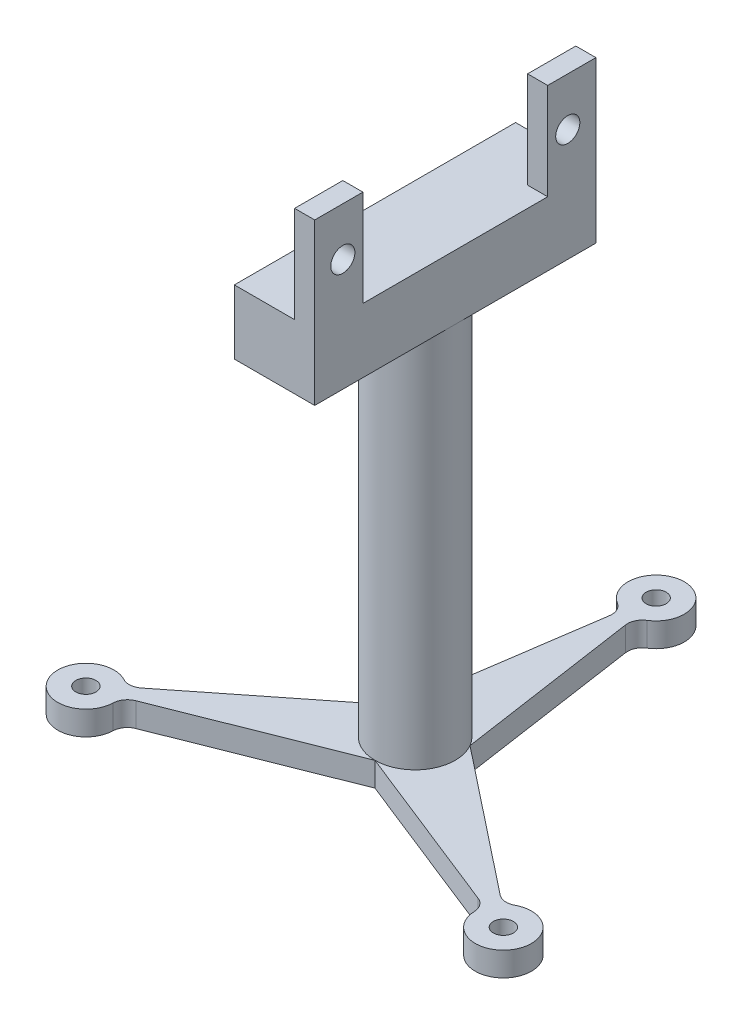
ISO-10303-21;
HEADER;
FILE_DESCRIPTION(('STEP AP214'),'2;1');
FILE_NAME('part.step','',(''),(''),'','','');
FILE_SCHEMA(('AUTOMOTIVE_DESIGN { 1 0 10303 214 1 1 1 1 }'));
ENDSEC;
DATA;
#1=APPLICATION_CONTEXT('core data for automotive mechanical design processes');
#2=APPLICATION_PROTOCOL_DEFINITION('international standard','automotive_design',2000,#1);
#3=PRODUCT_CONTEXT('',#1,'mechanical');
#4=PRODUCT('Part','Part','',(#3));
#5=PRODUCT_RELATED_PRODUCT_CATEGORY('part','',(#4));
#6=PRODUCT_DEFINITION_FORMATION('','',#4);
#7=PRODUCT_DEFINITION_CONTEXT('part definition',#1,'design');
#8=PRODUCT_DEFINITION('design','',#6,#7);
#9=PRODUCT_DEFINITION_SHAPE('','',#8);
#10=(LENGTH_UNIT() NAMED_UNIT(*) SI_UNIT(.MILLI.,.METRE.));
#11=(NAMED_UNIT(*) PLANE_ANGLE_UNIT() SI_UNIT($,.RADIAN.));
#12=(NAMED_UNIT(*) SI_UNIT($,.STERADIAN.) SOLID_ANGLE_UNIT());
#13=UNCERTAINTY_MEASURE_WITH_UNIT(LENGTH_MEASURE(1.E-05),#10,'distance_accuracy_value','');
#14=(GEOMETRIC_REPRESENTATION_CONTEXT(3) GLOBAL_UNCERTAINTY_ASSIGNED_CONTEXT((#13)) GLOBAL_UNIT_ASSIGNED_CONTEXT((#10,
#11,#12)) REPRESENTATION_CONTEXT('',''));
#15=CARTESIAN_POINT('',(0.,0.,0.));
#16=DIRECTION('',(0.,0.,1.));
#17=DIRECTION('',(1.,0.,0.));
#18=AXIS2_PLACEMENT_3D('',#15,#16,#17);
#19=CARTESIAN_POINT('',(-5.,58.,0.));
#20=DIRECTION('',(0.,-1.,0.));
#21=DIRECTION('',(0.,0.,-1.));
#22=AXIS2_PLACEMENT_3D('',#19,#20,#21);
#23=PLANE('',#22);
#24=DIRECTION('',(-1.,0.,0.));
#25=VECTOR('',#24,1.);
#26=CARTESIAN_POINT('',(5.,58.,-11.5));
#27=LINE('',#26,#25);
#28=CARTESIAN_POINT('',(5.,58.,-11.5));
#29=VERTEX_POINT('',#28);
#30=CARTESIAN_POINT('',(2.5,58.,-11.5));
#31=VERTEX_POINT('',#30);
#32=EDGE_CURVE('E265',#29,#31,#27,.T.);
#33=ORIENTED_EDGE('',*,*,#32,.T.);
#34=DIRECTION('',(0.,0.,1.));
#35=VECTOR('',#34,1.);
#36=CARTESIAN_POINT('',(2.5,58.,-33.5));
#37=LINE('',#36,#35);
#38=CARTESIAN_POINT('',(2.5,58.,-17.5));
#39=VERTEX_POINT('',#38);
#40=EDGE_CURVE('E227',#39,#31,#37,.T.);
#41=ORIENTED_EDGE('',*,*,#40,.F.);
#42=DIRECTION('',(1.,0.,0.));
#43=VECTOR('',#42,1.);
#44=CARTESIAN_POINT('',(-5.,58.,-17.5));
#45=LINE('',#44,#43);
#46=CARTESIAN_POINT('',(-5.,58.,-17.5));
#47=VERTEX_POINT('',#46);
#48=EDGE_CURVE('E564',#47,#39,#45,.T.);
#49=ORIENTED_EDGE('',*,*,#48,.F.);
#50=DIRECTION('',(0.,0.,-1.));
#51=VECTOR('',#50,1.);
#52=CARTESIAN_POINT('',(-5.,58.,0.));
#53=LINE('',#52,#51);
#54=CARTESIAN_POINT('',(-5.,58.,17.5));
#55=VERTEX_POINT('',#54);
#56=EDGE_CURVE('E213',#55,#47,#53,.T.);
#57=ORIENTED_EDGE('',*,*,#56,.F.);
#58=DIRECTION('',(1.,0.,0.));
#59=VECTOR('',#58,1.);
#60=CARTESIAN_POINT('',(-5.,58.,17.5));
#61=LINE('',#60,#59);
#62=CARTESIAN_POINT('',(2.5,58.,17.5));
#63=VERTEX_POINT('',#62);
#64=EDGE_CURVE('E208',#55,#63,#61,.T.);
#65=ORIENTED_EDGE('',*,*,#64,.T.);
#66=CARTESIAN_POINT('',(2.5,58.,11.5));
#67=VERTEX_POINT('',#66);
#68=EDGE_CURVE('E210',#67,#63,#37,.T.);
#69=ORIENTED_EDGE('',*,*,#68,.F.);
#70=DIRECTION('',(-1.,0.,0.));
#71=VECTOR('',#70,1.);
#72=CARTESIAN_POINT('',(5.,58.,11.5));
#73=LINE('',#72,#71);
#74=CARTESIAN_POINT('',(5.,58.,11.5));
#75=VERTEX_POINT('',#74);
#76=EDGE_CURVE('E57',#75,#67,#73,.T.);
#77=ORIENTED_EDGE('',*,*,#76,.F.);
#78=DIRECTION('',(0.,0.,-1.));
#79=VECTOR('',#78,1.);
#80=CARTESIAN_POINT('',(5.,58.,0.));
#81=LINE('',#80,#79);
#82=EDGE_CURVE('E52',#75,#29,#81,.T.);
#83=ORIENTED_EDGE('',*,*,#82,.T.);
#84=EDGE_LOOP('',(#33,#41,#49,#57,#65,#69,#77,#83));
#85=FACE_BOUND('',#84,.T.);
#86=ADVANCED_FACE('F35',(#85),#23,.F.);
#87=CARTESIAN_POINT('',(0.,0.,0.));
#88=DIRECTION('',(0.,-1.,0.));
#89=DIRECTION('',(0.,0.,-1.));
#90=AXIS2_PLACEMENT_3D('',#87,#88,#89);
#91=CYLINDRICAL_SURFACE('',#90,5.);
#92=CARTESIAN_POINT('',(0.,3.,0.));
#93=DIRECTION('',(0.,1.,0.));
#94=DIRECTION('',(0.,0.,1.));
#95=AXIS2_PLACEMENT_3D('',#92,#93,#94);
#96=CIRCLE('',#95,5.);
#97=CARTESIAN_POINT('',(0.,3.,5.));
#98=VERTEX_POINT('',#97);
#99=CARTESIAN_POINT('',(-4.33012701892217,3.,-2.50000000000004));
#100=VERTEX_POINT('',#99);
#101=EDGE_CURVE('E11',#98,#100,#96,.F.);
#102=ORIENTED_EDGE('',*,*,#101,.F.);
#103=CARTESIAN_POINT('',(0.,3.,0.));
#104=DIRECTION('',(0.,1.,0.));
#105=DIRECTION('',(0.,0.,1.));
#106=AXIS2_PLACEMENT_3D('',#103,#104,#105);
#107=CIRCLE('',#106,5.);
#108=CARTESIAN_POINT('',(4.33012701892221,3.,-2.49999999999998));
#109=VERTEX_POINT('',#108);
#110=EDGE_CURVE('E44',#109,#98,#107,.F.);
#111=ORIENTED_EDGE('',*,*,#110,.F.);
#112=CARTESIAN_POINT('',(0.,3.,0.));
#113=DIRECTION('',(0.,1.,0.));
#114=DIRECTION('',(0.,0.,1.));
#115=AXIS2_PLACEMENT_3D('',#112,#113,#114);
#116=CIRCLE('',#115,5.);
#117=EDGE_CURVE('E457',#100,#109,#116,.F.);
#118=ORIENTED_EDGE('',*,*,#117,.F.);
#119=EDGE_LOOP('',(#102,#111,#118));
#120=FACE_BOUND('',#119,.T.);
#121=CARTESIAN_POINT('',(0.,50.,0.));
#122=DIRECTION('',(0.,-1.,0.));
#123=DIRECTION('',(0.,0.,-1.));
#124=AXIS2_PLACEMENT_3D('',#121,#122,#123);
#125=CIRCLE('',#124,5.);
#126=CARTESIAN_POINT('',(5.,50.,0.));
#127=VERTEX_POINT('',#126);
#128=CARTESIAN_POINT('',(-5.,50.,0.));
#129=VERTEX_POINT('',#128);
#130=EDGE_CURVE('E454',#127,#129,#125,.T.);
#131=ORIENTED_EDGE('',*,*,#130,.T.);
#132=EDGE_CURVE('E453',#129,#127,#125,.T.);
#133=ORIENTED_EDGE('',*,*,#132,.T.);
#134=EDGE_LOOP('',(#131,#133));
#135=FACE_BOUND('',#134,.T.);
#136=ADVANCED_FACE('F312',(#120,#135),#91,.T.);
#137=CARTESIAN_POINT('',(5.00000000000001,0.,0.));
#138=DIRECTION('',(0.,-1.,0.));
#139=DIRECTION('',(0.,0.,-1.));
#140=AXIS2_PLACEMENT_3D('',#137,#138,#139);
#141=PLANE('',#140);
#142=DIRECTION('',(0.929467097060338,0.,0.368905022305509));
#143=VECTOR('',#142,1.);
#144=CARTESIAN_POINT('',(-1.71442540086641,0.,4.31954542258887));
#145=LINE('',#144,#143);
#146=CARTESIAN_POINT('',(0.,0.,5.));
#147=VERTEX_POINT('',#146);
#148=CARTESIAN_POINT('',(21.3094097195099,0.,13.4576939762104));
#149=VERTEX_POINT('',#148);
#150=EDGE_CURVE('E501',#147,#149,#145,.T.);
#151=ORIENTED_EDGE('',*,*,#150,.F.);
#152=DIRECTION('',(-0.929467097060343,0.,0.368905022305496));
#153=VECTOR('',#152,1.);
#154=CARTESIAN_POINT('',(1.71442540086635,0.,4.31954542258889));
#155=LINE('',#154,#153);
#156=CARTESIAN_POINT('',(-21.3094097195101,0.,13.4576939762101));
#157=VERTEX_POINT('',#156);
#158=EDGE_CURVE('E553',#147,#157,#155,.T.);
#159=ORIENTED_EDGE('',*,*,#158,.T.);
#160=CARTESIAN_POINT('',(-20.6227776308189,0.,15.1876837991618));
#161=DIRECTION('',(0.,1.,0.));
#162=DIRECTION('',(0.866025403784443,0.,-0.499999999999992));
#163=AXIS2_PLACEMENT_3D('',#160,#161,#162);
#164=CIRCLE('',#163,1.86127064467707);
#165=CARTESIAN_POINT('',(-22.4829074196802,0.,15.1225256735953));
#166=VERTEX_POINT('',#165);
#167=EDGE_CURVE('E489',#157,#166,#164,.T.);
#168=ORIENTED_EDGE('',*,*,#167,.T.);
#169=CARTESIAN_POINT('',(-25.9807621135333,0.,14.9999999999998));
#170=DIRECTION('',(0.,1.,0.));
#171=DIRECTION('',(0.866025403784443,0.,-0.499999999999992));
#172=AXIS2_PLACEMENT_3D('',#169,#170,#171);
#173=CIRCLE('',#172,3.5);
#174=CARTESIAN_POINT('',(-24.3379451125562,0.,11.9095061395786));
#175=VERTEX_POINT('',#174);
#176=EDGE_CURVE('E559',#175,#166,#173,.T.);
#177=ORIENTED_EDGE('',*,*,#176,.F.);
#178=CARTESIAN_POINT('',(-23.4643088101291,0.,10.2660074253053));
#179=DIRECTION('',(0.,1.,0.));
#180=DIRECTION('',(0.866025403784443,0.,-0.499999999999992));
#181=AXIS2_PLACEMENT_3D('',#178,#179,#180);
#182=CIRCLE('',#181,1.86127064467707);
#183=CARTESIAN_POINT('',(-22.30940971951,0.,11.7256431686413));
#184=VERTEX_POINT('',#183);
#185=EDGE_CURVE('E537',#184,#175,#182,.F.);
#186=ORIENTED_EDGE('',*,*,#185,.F.);
#187=DIRECTION('',(-0.784214669430408,0.,0.620489606883271));
#188=VECTOR('',#187,1.);
#189=CARTESIAN_POINT('',(-2.88362336832953,0.,-3.64450866133807));
#190=LINE('',#189,#188);
#191=CARTESIAN_POINT('',(-4.33012701892217,0.,-2.50000000000004));
#192=VERTEX_POINT('',#191);
#193=EDGE_CURVE('E535',#192,#184,#190,.T.);
#194=ORIENTED_EDGE('',*,*,#193,.F.);
#195=DIRECTION('',(0.145252427629938,0.,-0.989394629188783));
#196=VECTOR('',#195,1.);
#197=CARTESIAN_POINT('',(-4.59804876919595,0.,-0.675036761250828));
#198=LINE('',#197,#196);
#199=CARTESIAN_POINT('',(-1.,0.,-25.1833371448518));
#200=VERTEX_POINT('',#199);
#201=EDGE_CURVE('E433',#192,#200,#198,.T.);
#202=ORIENTED_EDGE('',*,*,#201,.T.);
#203=CARTESIAN_POINT('',(-2.84153117931023,0.,-25.4536912244675));
#204=DIRECTION('',(0.,1.,0.));
#205=DIRECTION('',(0.,0.,1.));
#206=AXIS2_PLACEMENT_3D('',#203,#204,#205);
#207=CIRCLE('',#206,1.86127064467707);
#208=CARTESIAN_POINT('',(-1.85503769287605,0.,-27.0320318131744));
#209=VERTEX_POINT('',#208);
#210=EDGE_CURVE('E430',#200,#209,#207,.T.);
#211=ORIENTED_EDGE('',*,*,#210,.T.);
#212=CARTESIAN_POINT('',(0.,0.,-30.));
#213=DIRECTION('',(0.,1.,0.));
#214=DIRECTION('',(0.,0.,1.));
#215=AXIS2_PLACEMENT_3D('',#212,#213,#214);
#216=CIRCLE('',#215,3.5);
#217=CARTESIAN_POINT('',(1.85503769287605,0.,-27.0320318131744));
#218=VERTEX_POINT('',#217);
#219=EDGE_CURVE('E419',#218,#209,#216,.T.);
#220=ORIENTED_EDGE('',*,*,#219,.F.);
#221=CARTESIAN_POINT('',(2.84153117931023,0.,-25.4536912244675));
#222=DIRECTION('',(0.,1.,0.));
#223=DIRECTION('',(0.,0.,1.));
#224=AXIS2_PLACEMENT_3D('',#221,#222,#223);
#225=CIRCLE('',#224,1.86127064467707);
#226=CARTESIAN_POINT('',(0.999999999999999,0.,-25.1833371448518));
#227=VERTEX_POINT('',#226);
#228=EDGE_CURVE('E415',#227,#218,#225,.F.);
#229=ORIENTED_EDGE('',*,*,#228,.F.);
#230=DIRECTION('',(-0.145252427629938,0.,-0.989394629188783));
#231=VECTOR('',#230,1.);
#232=CARTESIAN_POINT('',(4.59804876919595,0.,-0.675036761250828));
#233=LINE('',#232,#231);
#234=CARTESIAN_POINT('',(4.3301270189222,0.,-2.5));
#235=VERTEX_POINT('',#234);
#236=EDGE_CURVE('E436',#235,#227,#233,.T.);
#237=ORIENTED_EDGE('',*,*,#236,.F.);
#238=DIRECTION('',(0.784214669430399,0.,0.620489606883282));
#239=VECTOR('',#238,1.);
#240=CARTESIAN_POINT('',(2.88362336832958,0.,-3.64450866133804));
#241=LINE('',#240,#239);
#242=CARTESIAN_POINT('',(22.3094097195099,0.,11.7256431686416));
#243=VERTEX_POINT('',#242);
#244=EDGE_CURVE('E498',#235,#243,#241,.T.);
#245=ORIENTED_EDGE('',*,*,#244,.T.);
#246=CARTESIAN_POINT('',(23.464308810129,0.,10.2660074253056));
#247=DIRECTION('',(0.,1.,0.));
#248=DIRECTION('',(-0.866025403784436,0.,-0.500000000000004));
#249=AXIS2_PLACEMENT_3D('',#246,#247,#248);
#250=CIRCLE('',#249,1.86127064467707);
#251=CARTESIAN_POINT('',(24.3379451125561,0.,11.909506139579));
#252=VERTEX_POINT('',#251);
#253=EDGE_CURVE('E495',#243,#252,#250,.T.);
#254=ORIENTED_EDGE('',*,*,#253,.T.);
#255=CARTESIAN_POINT('',(25.9807621135331,0.,15.0000000000001));
#256=DIRECTION('',(0.,1.,0.));
#257=DIRECTION('',(-0.866025403784436,0.,-0.500000000000004));
#258=AXIS2_PLACEMENT_3D('',#255,#256,#257);
#259=CIRCLE('',#258,3.5);
#260=CARTESIAN_POINT('',(22.48290741968,0.,15.1225256735956));
#261=VERTEX_POINT('',#260);
#262=EDGE_CURVE('E492',#261,#252,#259,.T.);
#263=ORIENTED_EDGE('',*,*,#262,.F.);
#264=CARTESIAN_POINT('',(20.6227776308187,0.,15.1876837991621));
#265=DIRECTION('',(0.,1.,0.));
#266=DIRECTION('',(-0.866025403784436,0.,-0.500000000000004));
#267=AXIS2_PLACEMENT_3D('',#264,#265,#266);
#268=CIRCLE('',#267,1.86127064467707);
#269=EDGE_CURVE('E488',#149,#261,#268,.F.);
#270=ORIENTED_EDGE('',*,*,#269,.F.);
#271=EDGE_LOOP('',(#151,#159,#168,#177,#186,#194,#202,#211,#220,#229,#237,#245,#254,#263,#270));
#272=FACE_BOUND('',#271,.T.);
#273=CARTESIAN_POINT('',(25.9807621135331,0.,15.0000000000001));
#274=DIRECTION('',(0.,1.,0.));
#275=DIRECTION('',(-0.866025403784436,0.,-0.500000000000004));
#276=AXIS2_PLACEMENT_3D('',#273,#274,#275);
#277=CIRCLE('',#276,1.25);
#278=CARTESIAN_POINT('',(24.8982303588025,0.,14.3750000000001));
#279=VERTEX_POINT('',#278);
#280=EDGE_CURVE('E485',#279,#279,#277,.T.);
#281=ORIENTED_EDGE('',*,*,#280,.T.);
#282=EDGE_LOOP('',(#281));
#283=FACE_BOUND('',#282,.T.);
#284=CARTESIAN_POINT('',(0.,0.,-30.));
#285=DIRECTION('',(0.,1.,0.));
#286=DIRECTION('',(0.,0.,1.));
#287=AXIS2_PLACEMENT_3D('',#284,#285,#286);
#288=CIRCLE('',#287,1.25);
#289=CARTESIAN_POINT('',(0.,0.,-28.75));
#290=VERTEX_POINT('',#289);
#291=EDGE_CURVE('E413',#290,#290,#288,.T.);
#292=ORIENTED_EDGE('',*,*,#291,.T.);
#293=EDGE_LOOP('',(#292));
#294=FACE_BOUND('',#293,.T.);
#295=CARTESIAN_POINT('',(-25.9807621135333,0.,14.9999999999998));
#296=DIRECTION('',(0.,1.,0.));
#297=DIRECTION('',(0.866025403784443,0.,-0.499999999999992));
#298=AXIS2_PLACEMENT_3D('',#295,#296,#297);
#299=CIRCLE('',#298,1.25);
#300=CARTESIAN_POINT('',(-24.8982303588027,0.,14.3749999999998));
#301=VERTEX_POINT('',#300);
#302=EDGE_CURVE('E556',#301,#301,#299,.T.);
#303=ORIENTED_EDGE('',*,*,#302,.T.);
#304=EDGE_LOOP('',(#303));
#305=FACE_BOUND('',#304,.T.);
#306=ADVANCED_FACE('F37',(#272,#283,#294,#305),#141,.T.);
#307=CARTESIAN_POINT('',(2.84153117931023,3.,-25.4536912244675));
#308=DIRECTION('',(0.,-1.,0.));
#309=DIRECTION('',(0.,0.,-1.));
#310=AXIS2_PLACEMENT_3D('',#307,#308,#309);
#311=CYLINDRICAL_SURFACE('',#310,1.86127064467707);
#312=ORIENTED_EDGE('',*,*,#228,.T.);
#313=DIRECTION('',(0.,-1.,0.));
#314=VECTOR('',#313,1.);
#315=CARTESIAN_POINT('',(1.85503769287605,3.,-27.0320318131744));
#316=LINE('',#315,#314);
#317=CARTESIAN_POINT('',(1.85503769287605,3.,-27.0320318131744));
#318=VERTEX_POINT('',#317);
#319=EDGE_CURVE('E450',#318,#218,#316,.T.);
#320=ORIENTED_EDGE('',*,*,#319,.F.);
#321=CARTESIAN_POINT('',(2.84153117931023,3.,-25.4536912244675));
#322=DIRECTION('',(0.,1.,0.));
#323=DIRECTION('',(0.,0.,1.));
#324=AXIS2_PLACEMENT_3D('',#321,#322,#323);
#325=CIRCLE('',#324,1.86127064467707);
#326=CARTESIAN_POINT('',(0.999999999999999,3.,-25.1833371448518));
#327=VERTEX_POINT('',#326);
#328=EDGE_CURVE('E509',#327,#318,#325,.F.);
#329=ORIENTED_EDGE('',*,*,#328,.F.);
#330=DIRECTION('',(0.,-1.,0.));
#331=VECTOR('',#330,1.);
#332=CARTESIAN_POINT('',(0.999999999999999,3.,-25.1833371448518));
#333=LINE('',#332,#331);
#334=EDGE_CURVE('E438',#327,#227,#333,.T.);
#335=ORIENTED_EDGE('',*,*,#334,.T.);
#336=EDGE_LOOP('',(#312,#320,#329,#335));
#337=FACE_BOUND('',#336,.T.);
#338=ADVANCED_FACE('F398',(#337),#311,.F.);
#339=CARTESIAN_POINT('',(0.,3.,-30.));
#340=DIRECTION('',(0.,-1.,0.));
#341=DIRECTION('',(0.,0.,-1.));
#342=AXIS2_PLACEMENT_3D('',#339,#340,#341);
#343=CYLINDRICAL_SURFACE('',#342,3.5);
#344=ORIENTED_EDGE('',*,*,#219,.T.);
#345=DIRECTION('',(0.,-1.,0.));
#346=VECTOR('',#345,1.);
#347=CARTESIAN_POINT('',(-1.85503769287605,3.,-27.0320318131744));
#348=LINE('',#347,#346);
#349=CARTESIAN_POINT('',(-1.85503769287605,3.,-27.0320318131744));
#350=VERTEX_POINT('',#349);
#351=EDGE_CURVE('E448',#350,#209,#348,.T.);
#352=ORIENTED_EDGE('',*,*,#351,.F.);
#353=CARTESIAN_POINT('',(0.,3.,-30.));
#354=DIRECTION('',(0.,1.,0.));
#355=DIRECTION('',(0.,0.,1.));
#356=AXIS2_PLACEMENT_3D('',#353,#354,#355);
#357=CIRCLE('',#356,3.5);
#358=EDGE_CURVE('E512',#318,#350,#357,.T.);
#359=ORIENTED_EDGE('',*,*,#358,.F.);
#360=ORIENTED_EDGE('',*,*,#319,.T.);
#361=EDGE_LOOP('',(#344,#352,#359,#360));
#362=FACE_BOUND('',#361,.T.);
#363=ADVANCED_FACE('F394',(#362),#343,.T.);
#364=CARTESIAN_POINT('',(-2.84153117931023,3.,-25.4536912244675));
#365=DIRECTION('',(0.,-1.,0.));
#366=DIRECTION('',(0.,0.,-1.));
#367=AXIS2_PLACEMENT_3D('',#364,#365,#366);
#368=CYLINDRICAL_SURFACE('',#367,1.86127064467707);
#369=ORIENTED_EDGE('',*,*,#210,.F.);
#370=DIRECTION('',(0.,-1.,0.));
#371=VECTOR('',#370,1.);
#372=CARTESIAN_POINT('',(-1.,3.,-25.1833371448518));
#373=LINE('',#372,#371);
#374=CARTESIAN_POINT('',(-1.,3.,-25.1833371448518));
#375=VERTEX_POINT('',#374);
#376=EDGE_CURVE('E446',#375,#200,#373,.T.);
#377=ORIENTED_EDGE('',*,*,#376,.F.);
#378=CARTESIAN_POINT('',(-2.84153117931023,3.,-25.4536912244675));
#379=DIRECTION('',(0.,1.,0.));
#380=DIRECTION('',(0.,0.,1.));
#381=AXIS2_PLACEMENT_3D('',#378,#379,#380);
#382=CIRCLE('',#381,1.86127064467707);
#383=EDGE_CURVE('E514',#375,#350,#382,.T.);
#384=ORIENTED_EDGE('',*,*,#383,.T.);
#385=ORIENTED_EDGE('',*,*,#351,.T.);
#386=EDGE_LOOP('',(#369,#377,#384,#385));
#387=FACE_BOUND('',#386,.T.);
#388=ADVANCED_FACE('F390',(#387),#368,.F.);
#389=CARTESIAN_POINT('',(-4.59804876919595,3.,-0.675036761250828));
#390=DIRECTION('',(-0.989394629188783,0.,-0.145252427629938));
#391=DIRECTION('',(-0.145252427629938,0.,0.989394629188783));
#392=AXIS2_PLACEMENT_3D('',#389,#390,#391);
#393=PLANE('',#392);
#394=ORIENTED_EDGE('',*,*,#201,.F.);
#395=DIRECTION('',(0.,-1.,0.));
#396=VECTOR('',#395,1.);
#397=CARTESIAN_POINT('',(-4.33012701892219,3.,-2.5));
#398=LINE('',#397,#396);
#399=EDGE_CURVE('E444',#100,#192,#398,.T.);
#400=ORIENTED_EDGE('',*,*,#399,.F.);
#401=DIRECTION('',(0.145252427629938,0.,-0.989394629188783));
#402=VECTOR('',#401,1.);
#403=CARTESIAN_POINT('',(-4.59804876919595,3.,-0.675036761250828));
#404=LINE('',#403,#402);
#405=EDGE_CURVE('E516',#100,#375,#404,.T.);
#406=ORIENTED_EDGE('',*,*,#405,.T.);
#407=ORIENTED_EDGE('',*,*,#376,.T.);
#408=EDGE_LOOP('',(#394,#400,#406,#407));
#409=FACE_BOUND('',#408,.T.);
#410=ADVANCED_FACE('F387',(#409),#393,.T.);
#411=CARTESIAN_POINT('',(0.,3.,-30.));
#412=DIRECTION('',(0.,-1.,0.));
#413=DIRECTION('',(0.,0.,-1.));
#414=AXIS2_PLACEMENT_3D('',#411,#412,#413);
#415=CYLINDRICAL_SURFACE('',#414,1.25);
#416=CARTESIAN_POINT('',(0.,3.,-30.));
#417=DIRECTION('',(0.,1.,0.));
#418=DIRECTION('',(0.,0.,1.));
#419=AXIS2_PLACEMENT_3D('',#416,#417,#418);
#420=CIRCLE('',#419,1.25);
#421=CARTESIAN_POINT('',(0.,3.,-28.75));
#422=VERTEX_POINT('',#421);
#423=EDGE_CURVE('E410',#422,#422,#420,.T.);
#424=ORIENTED_EDGE('',*,*,#423,.T.);
#425=EDGE_LOOP('',(#424));
#426=FACE_BOUND('',#425,.T.);
#427=ORIENTED_EDGE('',*,*,#291,.F.);
#428=EDGE_LOOP('',(#427));
#429=FACE_BOUND('',#428,.T.);
#430=ADVANCED_FACE('F385',(#426,#429),#415,.F.);
#431=CARTESIAN_POINT('',(4.59804876919595,3.,-0.675036761250828));
#432=DIRECTION('',(-0.989394629188783,0.,0.145252427629938));
#433=DIRECTION('',(0.145252427629938,0.,0.989394629188783));
#434=AXIS2_PLACEMENT_3D('',#431,#432,#433);
#435=PLANE('',#434);
#436=ORIENTED_EDGE('',*,*,#236,.T.);
#437=ORIENTED_EDGE('',*,*,#334,.F.);
#438=DIRECTION('',(-0.145252427629938,0.,-0.989394629188783));
#439=VECTOR('',#438,1.);
#440=CARTESIAN_POINT('',(4.59804876919595,3.,-0.675036761250828));
#441=LINE('',#440,#439);
#442=EDGE_CURVE('E425',#109,#327,#441,.T.);
#443=ORIENTED_EDGE('',*,*,#442,.F.);
#444=DIRECTION('',(0.,-1.,0.));
#445=VECTOR('',#444,1.);
#446=CARTESIAN_POINT('',(4.33012701892219,3.,-2.5));
#447=LINE('',#446,#445);
#448=EDGE_CURVE('E441',#109,#235,#447,.T.);
#449=ORIENTED_EDGE('',*,*,#448,.T.);
#450=EDGE_LOOP('',(#436,#437,#443,#449));
#451=FACE_BOUND('',#450,.T.);
#452=ADVANCED_FACE('F381',(#451),#435,.F.);
#453=CARTESIAN_POINT('',(0.,3.,0.));
#454=DIRECTION('',(0.,1.,0.));
#455=DIRECTION('',(0.,0.,1.));
#456=AXIS2_PLACEMENT_3D('',#453,#454,#455);
#457=PLANE('',#456);
#458=ORIENTED_EDGE('',*,*,#423,.F.);
#459=EDGE_LOOP('',(#458));
#460=FACE_BOUND('',#459,.T.);
#461=ORIENTED_EDGE('',*,*,#405,.F.);
#462=ORIENTED_EDGE('',*,*,#117,.T.);
#463=ORIENTED_EDGE('',*,*,#442,.T.);
#464=ORIENTED_EDGE('',*,*,#328,.T.);
#465=ORIENTED_EDGE('',*,*,#358,.T.);
#466=ORIENTED_EDGE('',*,*,#383,.F.);
#467=EDGE_LOOP('',(#461,#462,#463,#464,#465,#466));
#468=FACE_BOUND('',#467,.T.);
#469=ADVANCED_FACE('F374',(#460,#468),#457,.T.);
#470=CARTESIAN_POINT('',(20.6227776308187,3.,15.1876837991621));
#471=DIRECTION('',(0.,-1.,0.));
#472=DIRECTION('',(0.,0.,-1.));
#473=AXIS2_PLACEMENT_3D('',#470,#471,#472);
#474=CYLINDRICAL_SURFACE('',#473,1.86127064467707);
#475=ORIENTED_EDGE('',*,*,#269,.T.);
#476=DIRECTION('',(0.,-1.,0.));
#477=VECTOR('',#476,1.);
#478=CARTESIAN_POINT('',(22.48290741968,3.,15.1225256735956));
#479=LINE('',#478,#477);
#480=CARTESIAN_POINT('',(22.48290741968,3.,15.1225256735956));
#481=VERTEX_POINT('',#480);
#482=EDGE_CURVE('E416',#481,#261,#479,.T.);
#483=ORIENTED_EDGE('',*,*,#482,.F.);
#484=CARTESIAN_POINT('',(20.6227776308187,3.,15.1876837991621));
#485=DIRECTION('',(0.,1.,0.));
#486=DIRECTION('',(-0.866025403784436,0.,-0.500000000000004));
#487=AXIS2_PLACEMENT_3D('',#484,#485,#486);
#488=CIRCLE('',#487,1.86127064467707);
#489=CARTESIAN_POINT('',(21.3094097195099,3.,13.4576939762104));
#490=VERTEX_POINT('',#489);
#491=EDGE_CURVE('E579',#490,#481,#488,.F.);
#492=ORIENTED_EDGE('',*,*,#491,.F.);
#493=DIRECTION('',(0.,-1.,0.));
#494=VECTOR('',#493,1.);
#495=CARTESIAN_POINT('',(21.3094097195099,3.,13.4576939762104));
#496=LINE('',#495,#494);
#497=EDGE_CURVE('E477',#490,#149,#496,.T.);
#498=ORIENTED_EDGE('',*,*,#497,.T.);
#499=EDGE_LOOP('',(#475,#483,#492,#498));
#500=FACE_BOUND('',#499,.T.);
#501=ADVANCED_FACE('F370',(#500),#474,.F.);
#502=CARTESIAN_POINT('',(25.9807621135331,3.,15.0000000000001));
#503=DIRECTION('',(0.,-1.,0.));
#504=DIRECTION('',(0.,0.,-1.));
#505=AXIS2_PLACEMENT_3D('',#502,#503,#504);
#506=CYLINDRICAL_SURFACE('',#505,3.5);
#507=ORIENTED_EDGE('',*,*,#262,.T.);
#508=DIRECTION('',(0.,-1.,0.));
#509=VECTOR('',#508,1.);
#510=CARTESIAN_POINT('',(24.3379451125561,3.,11.909506139579));
#511=LINE('',#510,#509);
#512=CARTESIAN_POINT('',(24.3379451125561,3.,11.909506139579));
#513=VERTEX_POINT('',#512);
#514=EDGE_CURVE('E422',#513,#252,#511,.T.);
#515=ORIENTED_EDGE('',*,*,#514,.F.);
#516=CARTESIAN_POINT('',(25.9807621135331,3.,15.0000000000001));
#517=DIRECTION('',(0.,1.,0.));
#518=DIRECTION('',(-0.866025403784436,0.,-0.500000000000004));
#519=AXIS2_PLACEMENT_3D('',#516,#517,#518);
#520=CIRCLE('',#519,3.5);
#521=EDGE_CURVE('E581',#481,#513,#520,.T.);
#522=ORIENTED_EDGE('',*,*,#521,.F.);
#523=ORIENTED_EDGE('',*,*,#482,.T.);
#524=EDGE_LOOP('',(#507,#515,#522,#523));
#525=FACE_BOUND('',#524,.T.);
#526=ADVANCED_FACE('F366',(#525),#506,.T.);
#527=CARTESIAN_POINT('',(23.464308810129,3.,10.2660074253056));
#528=DIRECTION('',(0.,-1.,0.));
#529=DIRECTION('',(0.,0.,-1.));
#530=AXIS2_PLACEMENT_3D('',#527,#528,#529);
#531=CYLINDRICAL_SURFACE('',#530,1.86127064467707);
#532=ORIENTED_EDGE('',*,*,#253,.F.);
#533=DIRECTION('',(0.,-1.,0.));
#534=VECTOR('',#533,1.);
#535=CARTESIAN_POINT('',(22.3094097195099,3.,11.7256431686416));
#536=LINE('',#535,#534);
#537=CARTESIAN_POINT('',(22.3094097195099,3.,11.7256431686416));
#538=VERTEX_POINT('',#537);
#539=EDGE_CURVE('E505',#538,#243,#536,.T.);
#540=ORIENTED_EDGE('',*,*,#539,.F.);
#541=CARTESIAN_POINT('',(23.464308810129,3.,10.2660074253056));
#542=DIRECTION('',(0.,1.,0.));
#543=DIRECTION('',(-0.866025403784436,0.,-0.500000000000004));
#544=AXIS2_PLACEMENT_3D('',#541,#542,#543);
#545=CIRCLE('',#544,1.86127064467707);
#546=EDGE_CURVE('E481',#538,#513,#545,.T.);
#547=ORIENTED_EDGE('',*,*,#546,.T.);
#548=ORIENTED_EDGE('',*,*,#514,.T.);
#549=EDGE_LOOP('',(#532,#540,#547,#548));
#550=FACE_BOUND('',#549,.T.);
#551=ADVANCED_FACE('F362',(#550),#531,.F.);
#552=CARTESIAN_POINT('',(2.88362336832958,3.,-3.64450866133804));
#553=DIRECTION('',(0.620489606883282,0.,-0.784214669430399));
#554=DIRECTION('',(-0.784214669430399,0.,-0.620489606883282));
#555=AXIS2_PLACEMENT_3D('',#552,#553,#554);
#556=PLANE('',#555);
#557=ORIENTED_EDGE('',*,*,#244,.F.);
#558=ORIENTED_EDGE('',*,*,#448,.F.);
#559=DIRECTION('',(0.784214669430399,0.,0.620489606883282));
#560=VECTOR('',#559,1.);
#561=CARTESIAN_POINT('',(2.88362336832958,3.,-3.64450866133804));
#562=LINE('',#561,#560);
#563=EDGE_CURVE('E470',#109,#538,#562,.T.);
#564=ORIENTED_EDGE('',*,*,#563,.T.);
#565=ORIENTED_EDGE('',*,*,#539,.T.);
#566=EDGE_LOOP('',(#557,#558,#564,#565));
#567=FACE_BOUND('',#566,.T.);
#568=ADVANCED_FACE('F359',(#567),#556,.T.);
#569=CARTESIAN_POINT('',(25.9807621135331,3.,15.0000000000001));
#570=DIRECTION('',(0.,-1.,0.));
#571=DIRECTION('',(0.,0.,-1.));
#572=AXIS2_PLACEMENT_3D('',#569,#570,#571);
#573=CYLINDRICAL_SURFACE('',#572,1.25);
#574=CARTESIAN_POINT('',(25.9807621135331,3.,15.0000000000001));
#575=DIRECTION('',(0.,1.,0.));
#576=DIRECTION('',(-0.866025403784436,0.,-0.500000000000004));
#577=AXIS2_PLACEMENT_3D('',#574,#575,#576);
#578=CIRCLE('',#577,1.25);
#579=CARTESIAN_POINT('',(24.8982303588025,3.,14.3750000000001));
#580=VERTEX_POINT('',#579);
#581=EDGE_CURVE('E502',#580,#580,#578,.T.);
#582=ORIENTED_EDGE('',*,*,#581,.T.);
#583=EDGE_LOOP('',(#582));
#584=FACE_BOUND('',#583,.T.);
#585=ORIENTED_EDGE('',*,*,#280,.F.);
#586=EDGE_LOOP('',(#585));
#587=FACE_BOUND('',#586,.T.);
#588=ADVANCED_FACE('F357',(#584,#587),#573,.F.);
#589=CARTESIAN_POINT('',(-1.71442540086641,3.,4.31954542258887));
#590=DIRECTION('',(0.368905022305509,0.,-0.929467097060338));
#591=DIRECTION('',(-0.929467097060338,0.,-0.368905022305509));
#592=AXIS2_PLACEMENT_3D('',#589,#590,#591);
#593=PLANE('',#592);
#594=ORIENTED_EDGE('',*,*,#150,.T.);
#595=ORIENTED_EDGE('',*,*,#497,.F.);
#596=DIRECTION('',(0.929467097060338,0.,0.368905022305509));
#597=VECTOR('',#596,1.);
#598=CARTESIAN_POINT('',(-1.71442540086641,3.,4.31954542258887));
#599=LINE('',#598,#597);
#600=EDGE_CURVE('E466',#98,#490,#599,.T.);
#601=ORIENTED_EDGE('',*,*,#600,.F.);
#602=DIRECTION('',(0.,-1.,0.));
#603=VECTOR('',#602,1.);
#604=CARTESIAN_POINT('',(0.,3.,5.));
#605=LINE('',#604,#603);
#606=EDGE_CURVE('E474',#98,#147,#605,.T.);
#607=ORIENTED_EDGE('',*,*,#606,.T.);
#608=EDGE_LOOP('',(#594,#595,#601,#607));
#609=FACE_BOUND('',#608,.T.);
#610=ADVANCED_FACE('F353',(#609),#593,.F.);
#611=CARTESIAN_POINT('',(0.,3.,0.));
#612=DIRECTION('',(0.,1.,0.));
#613=DIRECTION('',(-0.866025403784436,0.,-0.500000000000004));
#614=AXIS2_PLACEMENT_3D('',#611,#612,#613);
#615=PLANE('',#614);
#616=ORIENTED_EDGE('',*,*,#581,.F.);
#617=EDGE_LOOP('',(#616));
#618=FACE_BOUND('',#617,.T.);
#619=ORIENTED_EDGE('',*,*,#563,.F.);
#620=ORIENTED_EDGE('',*,*,#110,.T.);
#621=ORIENTED_EDGE('',*,*,#600,.T.);
#622=ORIENTED_EDGE('',*,*,#491,.T.);
#623=ORIENTED_EDGE('',*,*,#521,.T.);
#624=ORIENTED_EDGE('',*,*,#546,.F.);
#625=EDGE_LOOP('',(#619,#620,#621,#622,#623,#624));
#626=FACE_BOUND('',#625,.T.);
#627=ADVANCED_FACE('F331',(#618,#626),#615,.T.);
#628=CARTESIAN_POINT('',(-23.4643088101291,3.,10.2660074253053));
#629=DIRECTION('',(0.,-1.,0.));
#630=DIRECTION('',(0.,0.,-1.));
#631=AXIS2_PLACEMENT_3D('',#628,#629,#630);
#632=CYLINDRICAL_SURFACE('',#631,1.86127064467707);
#633=ORIENTED_EDGE('',*,*,#185,.T.);
#634=DIRECTION('',(0.,-1.,0.));
#635=VECTOR('',#634,1.);
#636=CARTESIAN_POINT('',(-24.3379451125562,3.,11.9095061395786));
#637=LINE('',#636,#635);
#638=CARTESIAN_POINT('',(-24.3379451125562,3.,11.9095061395786));
#639=VERTEX_POINT('',#638);
#640=EDGE_CURVE('E562',#639,#175,#637,.T.);
#641=ORIENTED_EDGE('',*,*,#640,.F.);
#642=CARTESIAN_POINT('',(-23.4643088101291,3.,10.2660074253053));
#643=DIRECTION('',(0.,1.,0.));
#644=DIRECTION('',(0.866025403784443,0.,-0.499999999999992));
#645=AXIS2_PLACEMENT_3D('',#642,#643,#644);
#646=CIRCLE('',#645,1.86127064467707);
#647=CARTESIAN_POINT('',(-22.30940971951,3.,11.7256431686413));
#648=VERTEX_POINT('',#647);
#649=EDGE_CURVE('E540',#648,#639,#646,.F.);
#650=ORIENTED_EDGE('',*,*,#649,.F.);
#651=DIRECTION('',(0.,-1.,0.));
#652=VECTOR('',#651,1.);
#653=CARTESIAN_POINT('',(-22.30940971951,3.,11.7256431686413));
#654=LINE('',#653,#652);
#655=EDGE_CURVE('E551',#648,#184,#654,.T.);
#656=ORIENTED_EDGE('',*,*,#655,.T.);
#657=EDGE_LOOP('',(#633,#641,#650,#656));
#658=FACE_BOUND('',#657,.T.);
#659=ADVANCED_FACE('F327',(#658),#632,.F.);
#660=CARTESIAN_POINT('',(-25.9807621135333,3.,14.9999999999998));
#661=DIRECTION('',(0.,-1.,0.));
#662=DIRECTION('',(0.,0.,-1.));
#663=AXIS2_PLACEMENT_3D('',#660,#661,#662);
#664=CYLINDRICAL_SURFACE('',#663,3.5);
#665=ORIENTED_EDGE('',*,*,#176,.T.);
#666=DIRECTION('',(0.,-1.,0.));
#667=VECTOR('',#666,1.);
#668=CARTESIAN_POINT('',(-22.4829074196802,3.,15.1225256735953));
#669=LINE('',#668,#667);
#670=CARTESIAN_POINT('',(-22.4829074196802,3.,15.1225256735953));
#671=VERTEX_POINT('',#670);
#672=EDGE_CURVE('E572',#671,#166,#669,.T.);
#673=ORIENTED_EDGE('',*,*,#672,.F.);
#674=CARTESIAN_POINT('',(-25.9807621135333,3.,14.9999999999998));
#675=DIRECTION('',(0.,1.,0.));
#676=DIRECTION('',(0.866025403784443,0.,-0.499999999999992));
#677=AXIS2_PLACEMENT_3D('',#674,#675,#676);
#678=CIRCLE('',#677,3.5);
#679=EDGE_CURVE('E544',#639,#671,#678,.T.);
#680=ORIENTED_EDGE('',*,*,#679,.F.);
#681=ORIENTED_EDGE('',*,*,#640,.T.);
#682=EDGE_LOOP('',(#665,#673,#680,#681));
#683=FACE_BOUND('',#682,.T.);
#684=ADVANCED_FACE('F330',(#683),#664,.T.);
#685=CARTESIAN_POINT('',(-20.6227776308189,3.,15.1876837991618));
#686=DIRECTION('',(0.,-1.,0.));
#687=DIRECTION('',(0.,0.,-1.));
#688=AXIS2_PLACEMENT_3D('',#685,#686,#687);
#689=CYLINDRICAL_SURFACE('',#688,1.86127064467707);
#690=ORIENTED_EDGE('',*,*,#167,.F.);
#691=DIRECTION('',(0.,-1.,0.));
#692=VECTOR('',#691,1.);
#693=CARTESIAN_POINT('',(-21.3094097195101,3.,13.4576939762101));
#694=LINE('',#693,#692);
#695=CARTESIAN_POINT('',(-21.3094097195101,3.,13.4576939762101));
#696=VERTEX_POINT('',#695);
#697=EDGE_CURVE('E547',#696,#157,#694,.T.);
#698=ORIENTED_EDGE('',*,*,#697,.F.);
#699=CARTESIAN_POINT('',(-20.6227776308189,3.,15.1876837991618));
#700=DIRECTION('',(0.,1.,0.));
#701=DIRECTION('',(0.866025403784443,0.,-0.499999999999992));
#702=AXIS2_PLACEMENT_3D('',#699,#700,#701);
#703=CIRCLE('',#702,1.86127064467707);
#704=EDGE_CURVE('E573',#696,#671,#703,.T.);
#705=ORIENTED_EDGE('',*,*,#704,.T.);
#706=ORIENTED_EDGE('',*,*,#672,.T.);
#707=EDGE_LOOP('',(#690,#698,#705,#706));
#708=FACE_BOUND('',#707,.T.);
#709=ADVANCED_FACE('F335',(#708),#689,.F.);
#710=CARTESIAN_POINT('',(1.71442540086635,3.,4.31954542258889));
#711=DIRECTION('',(0.368905022305496,0.,0.929467097060343));
#712=DIRECTION('',(0.929467097060343,0.,-0.368905022305496));
#713=AXIS2_PLACEMENT_3D('',#710,#711,#712);
#714=PLANE('',#713);
#715=ORIENTED_EDGE('',*,*,#158,.F.);
#716=ORIENTED_EDGE('',*,*,#606,.F.);
#717=DIRECTION('',(-0.929467097060343,0.,0.368905022305496));
#718=VECTOR('',#717,1.);
#719=CARTESIAN_POINT('',(1.71442540086635,3.,4.31954542258889));
#720=LINE('',#719,#718);
#721=EDGE_CURVE('E569',#98,#696,#720,.T.);
#722=ORIENTED_EDGE('',*,*,#721,.T.);
#723=ORIENTED_EDGE('',*,*,#697,.T.);
#724=EDGE_LOOP('',(#715,#716,#722,#723));
#725=FACE_BOUND('',#724,.T.);
#726=ADVANCED_FACE('F325',(#725),#714,.T.);
#727=CARTESIAN_POINT('',(-25.9807621135333,3.,14.9999999999998));
#728=DIRECTION('',(0.,-1.,0.));
#729=DIRECTION('',(0.,0.,-1.));
#730=AXIS2_PLACEMENT_3D('',#727,#728,#729);
#731=CYLINDRICAL_SURFACE('',#730,1.25);
#732=CARTESIAN_POINT('',(-25.9807621135333,3.,14.9999999999998));
#733=DIRECTION('',(0.,1.,0.));
#734=DIRECTION('',(0.866025403784443,0.,-0.499999999999992));
#735=AXIS2_PLACEMENT_3D('',#732,#733,#734);
#736=CIRCLE('',#735,1.25);
#737=CARTESIAN_POINT('',(-24.8982303588027,3.,14.3749999999998));
#738=VERTEX_POINT('',#737);
#739=EDGE_CURVE('E541',#738,#738,#736,.T.);
#740=ORIENTED_EDGE('',*,*,#739,.T.);
#741=EDGE_LOOP('',(#740));
#742=FACE_BOUND('',#741,.T.);
#743=ORIENTED_EDGE('',*,*,#302,.F.);
#744=EDGE_LOOP('',(#743));
#745=FACE_BOUND('',#744,.T.);
#746=ADVANCED_FACE('F321',(#742,#745),#731,.F.);
#747=CARTESIAN_POINT('',(-2.88362336832953,3.,-3.64450866133807));
#748=DIRECTION('',(0.620489606883271,0.,0.784214669430408));
#749=DIRECTION('',(0.784214669430408,0.,-0.620489606883271));
#750=AXIS2_PLACEMENT_3D('',#747,#748,#749);
#751=PLANE('',#750);
#752=ORIENTED_EDGE('',*,*,#193,.T.);
#753=ORIENTED_EDGE('',*,*,#655,.F.);
#754=DIRECTION('',(-0.784214669430408,0.,0.620489606883271));
#755=VECTOR('',#754,1.);
#756=CARTESIAN_POINT('',(-2.88362336832953,3.,-3.64450866133807));
#757=LINE('',#756,#755);
#758=EDGE_CURVE('E567',#100,#648,#757,.T.);
#759=ORIENTED_EDGE('',*,*,#758,.F.);
#760=ORIENTED_EDGE('',*,*,#399,.T.);
#761=EDGE_LOOP('',(#752,#753,#759,#760));
#762=FACE_BOUND('',#761,.T.);
#763=ADVANCED_FACE('F324',(#762),#751,.F.);
#764=CARTESIAN_POINT('',(0.,3.,0.));
#765=DIRECTION('',(0.,1.,0.));
#766=DIRECTION('',(0.866025403784443,0.,-0.499999999999992));
#767=AXIS2_PLACEMENT_3D('',#764,#765,#766);
#768=PLANE('',#767);
#769=ORIENTED_EDGE('',*,*,#739,.F.);
#770=EDGE_LOOP('',(#769));
#771=FACE_BOUND('',#770,.T.);
#772=ORIENTED_EDGE('',*,*,#721,.F.);
#773=ORIENTED_EDGE('',*,*,#101,.T.);
#774=ORIENTED_EDGE('',*,*,#758,.T.);
#775=ORIENTED_EDGE('',*,*,#649,.T.);
#776=ORIENTED_EDGE('',*,*,#679,.T.);
#777=ORIENTED_EDGE('',*,*,#704,.F.);
#778=EDGE_LOOP('',(#772,#773,#774,#775,#776,#777));
#779=FACE_BOUND('',#778,.T.);
#780=ADVANCED_FACE('F345',(#771,#779),#768,.T.);
#781=CARTESIAN_POINT('',(-5.,50.,0.));
#782=DIRECTION('',(0.,1.,0.));
#783=DIRECTION('',(0.,0.,1.));
#784=AXIS2_PLACEMENT_3D('',#781,#782,#783);
#785=PLANE('',#784);
#786=ORIENTED_EDGE('',*,*,#130,.F.);
#787=DIRECTION('',(0.,0.,1.));
#788=VECTOR('',#787,1.);
#789=CARTESIAN_POINT('',(5.,50.,0.));
#790=LINE('',#789,#788);
#791=CARTESIAN_POINT('',(5.,50.,17.5));
#792=VERTEX_POINT('',#791);
#793=EDGE_CURVE('E605',#127,#792,#790,.T.);
#794=ORIENTED_EDGE('',*,*,#793,.T.);
#795=DIRECTION('',(1.,0.,0.));
#796=VECTOR('',#795,1.);
#797=CARTESIAN_POINT('',(-5.,50.,17.5));
#798=LINE('',#797,#796);
#799=CARTESIAN_POINT('',(-5.,50.,17.5));
#800=VERTEX_POINT('',#799);
#801=EDGE_CURVE('E217',#800,#792,#798,.T.);
#802=ORIENTED_EDGE('',*,*,#801,.F.);
#803=DIRECTION('',(0.,0.,1.));
#804=VECTOR('',#803,1.);
#805=CARTESIAN_POINT('',(-5.,50.,0.));
#806=LINE('',#805,#804);
#807=EDGE_CURVE('E607',#129,#800,#806,.T.);
#808=ORIENTED_EDGE('',*,*,#807,.F.);
#809=EDGE_LOOP('',(#786,#794,#802,#808));
#810=FACE_BOUND('',#809,.T.);
#811=ADVANCED_FACE('F349',(#810),#785,.F.);
#812=CARTESIAN_POINT('',(-5.,0.,-17.5));
#813=DIRECTION('',(0.,0.,1.));
#814=DIRECTION('',(0.,-1.,0.));
#815=AXIS2_PLACEMENT_3D('',#812,#813,#814);
#816=PLANE('',#815);
#817=ORIENTED_EDGE('',*,*,#48,.T.);
#818=DIRECTION('',(0.,1.,0.));
#819=VECTOR('',#818,1.);
#820=CARTESIAN_POINT('',(2.5,0.,-17.5));
#821=LINE('',#820,#819);
#822=CARTESIAN_POINT('',(2.5,70.,-17.5));
#823=VERTEX_POINT('',#822);
#824=EDGE_CURVE('E247',#39,#823,#821,.T.);
#825=ORIENTED_EDGE('',*,*,#824,.T.);
#826=DIRECTION('',(-1.,0.,0.));
#827=VECTOR('',#826,1.);
#828=CARTESIAN_POINT('',(5.,70.,-17.5));
#829=LINE('',#828,#827);
#830=CARTESIAN_POINT('',(5.,70.,-17.5));
#831=VERTEX_POINT('',#830);
#832=EDGE_CURVE('E262',#831,#823,#829,.T.);
#833=ORIENTED_EDGE('',*,*,#832,.F.);
#834=DIRECTION('',(0.,-1.,0.));
#835=VECTOR('',#834,1.);
#836=CARTESIAN_POINT('',(5.,0.,-17.5));
#837=LINE('',#836,#835);
#838=CARTESIAN_POINT('',(5.,50.,-17.5));
#839=VERTEX_POINT('',#838);
#840=EDGE_CURVE('E627',#831,#839,#837,.T.);
#841=ORIENTED_EDGE('',*,*,#840,.T.);
#842=DIRECTION('',(1.,0.,0.));
#843=VECTOR('',#842,1.);
#844=CARTESIAN_POINT('',(-5.,50.,-17.5));
#845=LINE('',#844,#843);
#846=CARTESIAN_POINT('',(-5.,50.,-17.5));
#847=VERTEX_POINT('',#846);
#848=EDGE_CURVE('E622',#847,#839,#845,.T.);
#849=ORIENTED_EDGE('',*,*,#848,.F.);
#850=DIRECTION('',(0.,-1.,0.));
#851=VECTOR('',#850,1.);
#852=CARTESIAN_POINT('',(-5.,0.,-17.5));
#853=LINE('',#852,#851);
#854=EDGE_CURVE('E218',#47,#847,#853,.T.);
#855=ORIENTED_EDGE('',*,*,#854,.F.);
#856=EDGE_LOOP('',(#817,#825,#833,#841,#849,#855));
#857=FACE_BOUND('',#856,.T.);
#858=ADVANCED_FACE('F633',(#857),#816,.F.);
#859=ORIENTED_EDGE('',*,*,#132,.F.);
#860=EDGE_CURVE('E610',#847,#129,#806,.T.);
#861=ORIENTED_EDGE('',*,*,#860,.F.);
#862=ORIENTED_EDGE('',*,*,#848,.T.);
#863=EDGE_CURVE('E626',#839,#127,#790,.T.);
#864=ORIENTED_EDGE('',*,*,#863,.T.);
#865=EDGE_LOOP('',(#859,#861,#862,#864));
#866=FACE_BOUND('',#865,.T.);
#867=ADVANCED_FACE('F643',(#866),#785,.F.);
#868=CARTESIAN_POINT('',(-5.,0.,17.5));
#869=DIRECTION('',(0.,0.,-1.));
#870=DIRECTION('',(0.,1.,0.));
#871=AXIS2_PLACEMENT_3D('',#868,#869,#870);
#872=PLANE('',#871);
#873=DIRECTION('',(-1.,0.,0.));
#874=VECTOR('',#873,1.);
#875=CARTESIAN_POINT('',(5.,70.,17.5));
#876=LINE('',#875,#874);
#877=CARTESIAN_POINT('',(5.,70.,17.5));
#878=VERTEX_POINT('',#877);
#879=CARTESIAN_POINT('',(2.5,70.,17.5));
#880=VERTEX_POINT('',#879);
#881=EDGE_CURVE('E232',#878,#880,#876,.T.);
#882=ORIENTED_EDGE('',*,*,#881,.T.);
#883=DIRECTION('',(0.,1.,0.));
#884=VECTOR('',#883,1.);
#885=CARTESIAN_POINT('',(2.5,58.,17.5));
#886=LINE('',#885,#884);
#887=EDGE_CURVE('E223',#63,#880,#886,.T.);
#888=ORIENTED_EDGE('',*,*,#887,.F.);
#889=ORIENTED_EDGE('',*,*,#64,.F.);
#890=DIRECTION('',(0.,1.,0.));
#891=VECTOR('',#890,1.);
#892=CARTESIAN_POINT('',(-5.,0.,17.5));
#893=LINE('',#892,#891);
#894=EDGE_CURVE('E611',#800,#55,#893,.T.);
#895=ORIENTED_EDGE('',*,*,#894,.F.);
#896=ORIENTED_EDGE('',*,*,#801,.T.);
#897=DIRECTION('',(0.,1.,0.));
#898=VECTOR('',#897,1.);
#899=CARTESIAN_POINT('',(5.,0.,17.5));
#900=LINE('',#899,#898);
#901=EDGE_CURVE('E280',#792,#878,#900,.T.);
#902=ORIENTED_EDGE('',*,*,#901,.T.);
#903=EDGE_LOOP('',(#882,#888,#889,#895,#896,#902));
#904=FACE_BOUND('',#903,.T.);
#905=ADVANCED_FACE('F230',(#904),#872,.F.);
#906=CARTESIAN_POINT('',(-5.,0.,0.));
#907=DIRECTION('',(1.,0.,0.));
#908=DIRECTION('',(0.,0.,-1.));
#909=AXIS2_PLACEMENT_3D('',#906,#907,#908);
#910=PLANE('',#909);
#911=ORIENTED_EDGE('',*,*,#56,.T.);
#912=ORIENTED_EDGE('',*,*,#854,.T.);
#913=ORIENTED_EDGE('',*,*,#860,.T.);
#914=ORIENTED_EDGE('',*,*,#807,.T.);
#915=ORIENTED_EDGE('',*,*,#894,.T.);
#916=EDGE_LOOP('',(#911,#912,#913,#914,#915));
#917=FACE_BOUND('',#916,.T.);
#918=ADVANCED_FACE('F614',(#917),#910,.F.);
#919=CARTESIAN_POINT('',(5.,0.,0.));
#920=DIRECTION('',(1.,0.,0.));
#921=DIRECTION('',(0.,0.,-1.));
#922=AXIS2_PLACEMENT_3D('',#919,#920,#921);
#923=PLANE('',#922);
#924=ORIENTED_EDGE('',*,*,#82,.F.);
#925=DIRECTION('',(0.,-1.,0.));
#926=VECTOR('',#925,1.);
#927=CARTESIAN_POINT('',(5.,0.,11.5));
#928=LINE('',#927,#926);
#929=CARTESIAN_POINT('',(5.,70.,11.5));
#930=VERTEX_POINT('',#929);
#931=EDGE_CURVE('E270',#930,#75,#928,.T.);
#932=ORIENTED_EDGE('',*,*,#931,.F.);
#933=DIRECTION('',(0.,0.,-1.));
#934=VECTOR('',#933,1.);
#935=CARTESIAN_POINT('',(5.,70.,0.));
#936=LINE('',#935,#934);
#937=EDGE_CURVE('E271',#878,#930,#936,.T.);
#938=ORIENTED_EDGE('',*,*,#937,.F.);
#939=ORIENTED_EDGE('',*,*,#901,.F.);
#940=ORIENTED_EDGE('',*,*,#793,.F.);
#941=ORIENTED_EDGE('',*,*,#863,.F.);
#942=ORIENTED_EDGE('',*,*,#840,.F.);
#943=DIRECTION('',(0.,0.,-1.));
#944=VECTOR('',#943,1.);
#945=CARTESIAN_POINT('',(5.,70.,1.61907524424502E-13));
#946=LINE('',#945,#944);
#947=CARTESIAN_POINT('',(5.,70.,-11.5));
#948=VERTEX_POINT('',#947);
#949=EDGE_CURVE('E256',#948,#831,#946,.T.);
#950=ORIENTED_EDGE('',*,*,#949,.F.);
#951=DIRECTION('',(0.,1.,0.));
#952=VECTOR('',#951,1.);
#953=CARTESIAN_POINT('',(5.,0.,-11.5));
#954=LINE('',#953,#952);
#955=EDGE_CURVE('E253',#29,#948,#954,.T.);
#956=ORIENTED_EDGE('',*,*,#955,.F.);
#957=EDGE_LOOP('',(#924,#932,#938,#939,#940,#941,#942,#950,#956));
#958=FACE_BOUND('',#957,.T.);
#959=CARTESIAN_POINT('',(5.,64.,14.));
#960=DIRECTION('',(1.,0.,0.));
#961=DIRECTION('',(0.,0.,-1.));
#962=AXIS2_PLACEMENT_3D('',#959,#960,#961);
#963=CIRCLE('',#962,1.5);
#964=CARTESIAN_POINT('',(5.,64.,12.5));
#965=VERTEX_POINT('',#964);
#966=EDGE_CURVE('E267',#965,#965,#963,.T.);
#967=ORIENTED_EDGE('',*,*,#966,.F.);
#968=EDGE_LOOP('',(#967));
#969=FACE_BOUND('',#968,.T.);
#970=CARTESIAN_POINT('',(5.,64.,-14.));
#971=DIRECTION('',(1.,0.,0.));
#972=DIRECTION('',(0.,0.,-1.));
#973=AXIS2_PLACEMENT_3D('',#970,#971,#972);
#974=CIRCLE('',#973,1.5);
#975=CARTESIAN_POINT('',(5.,64.,-15.5));
#976=VERTEX_POINT('',#975);
#977=EDGE_CURVE('E250',#976,#976,#974,.T.);
#978=ORIENTED_EDGE('',*,*,#977,.F.);
#979=EDGE_LOOP('',(#978));
#980=FACE_BOUND('',#979,.T.);
#981=ADVANCED_FACE('F293',(#958,#969,#980),#923,.T.);
#982=CARTESIAN_POINT('',(5.,0.,11.5));
#983=DIRECTION('',(0.,0.,-1.));
#984=DIRECTION('',(-1.,0.,0.));
#985=AXIS2_PLACEMENT_3D('',#982,#983,#984);
#986=PLANE('',#985);
#987=DIRECTION('',(0.,-1.,0.));
#988=VECTOR('',#987,1.);
#989=CARTESIAN_POINT('',(2.5,0.,11.5));
#990=LINE('',#989,#988);
#991=CARTESIAN_POINT('',(2.5,70.,11.5));
#992=VERTEX_POINT('',#991);
#993=EDGE_CURVE('E226',#992,#67,#990,.T.);
#994=ORIENTED_EDGE('',*,*,#993,.F.);
#995=DIRECTION('',(-1.,0.,0.));
#996=VECTOR('',#995,1.);
#997=CARTESIAN_POINT('',(5.,70.,11.5));
#998=LINE('',#997,#996);
#999=EDGE_CURVE('E275',#930,#992,#998,.T.);
#1000=ORIENTED_EDGE('',*,*,#999,.F.);
#1001=ORIENTED_EDGE('',*,*,#931,.T.);
#1002=ORIENTED_EDGE('',*,*,#76,.T.);
#1003=EDGE_LOOP('',(#994,#1000,#1001,#1002));
#1004=FACE_BOUND('',#1003,.T.);
#1005=ADVANCED_FACE('F290',(#1004),#986,.T.);
#1006=CARTESIAN_POINT('',(5.,70.,0.));
#1007=DIRECTION('',(0.,1.,0.));
#1008=DIRECTION('',(0.,0.,1.));
#1009=AXIS2_PLACEMENT_3D('',#1006,#1007,#1008);
#1010=PLANE('',#1009);
#1011=DIRECTION('',(0.,0.,1.));
#1012=VECTOR('',#1011,1.);
#1013=CARTESIAN_POINT('',(2.5,70.,-33.5));
#1014=LINE('',#1013,#1012);
#1015=EDGE_CURVE('E235',#992,#880,#1014,.T.);
#1016=ORIENTED_EDGE('',*,*,#1015,.T.);
#1017=ORIENTED_EDGE('',*,*,#881,.F.);
#1018=ORIENTED_EDGE('',*,*,#937,.T.);
#1019=ORIENTED_EDGE('',*,*,#999,.T.);
#1020=EDGE_LOOP('',(#1016,#1017,#1018,#1019));
#1021=FACE_BOUND('',#1020,.T.);
#1022=ADVANCED_FACE('F298',(#1021),#1010,.T.);
#1023=CARTESIAN_POINT('',(5.,64.,14.));
#1024=DIRECTION('',(-1.,0.,0.));
#1025=DIRECTION('',(0.,0.,1.));
#1026=AXIS2_PLACEMENT_3D('',#1023,#1024,#1025);
#1027=CYLINDRICAL_SURFACE('',#1026,1.5);
#1028=CARTESIAN_POINT('',(2.5,64.,14.));
#1029=DIRECTION('',(1.,0.,0.));
#1030=DIRECTION('',(0.,0.,-1.));
#1031=AXIS2_PLACEMENT_3D('',#1028,#1029,#1030);
#1032=CIRCLE('',#1031,1.5);
#1033=CARTESIAN_POINT('',(2.5,64.,12.5));
#1034=VERTEX_POINT('',#1033);
#1035=EDGE_CURVE('E243',#1034,#1034,#1032,.T.);
#1036=ORIENTED_EDGE('',*,*,#1035,.F.);
#1037=EDGE_LOOP('',(#1036));
#1038=FACE_BOUND('',#1037,.T.);
#1039=ORIENTED_EDGE('',*,*,#966,.T.);
#1040=EDGE_LOOP('',(#1039));
#1041=FACE_BOUND('',#1040,.T.);
#1042=ADVANCED_FACE('F300',(#1038,#1041),#1027,.F.);
#1043=CARTESIAN_POINT('',(5.,0.,-11.5));
#1044=DIRECTION('',(0.,0.,1.));
#1045=DIRECTION('',(0.,-1.,0.));
#1046=AXIS2_PLACEMENT_3D('',#1043,#1044,#1045);
#1047=PLANE('',#1046);
#1048=DIRECTION('',(0.,1.,0.));
#1049=VECTOR('',#1048,1.);
#1050=CARTESIAN_POINT('',(2.5,0.,-11.5));
#1051=LINE('',#1050,#1049);
#1052=CARTESIAN_POINT('',(2.5,70.,-11.5));
#1053=VERTEX_POINT('',#1052);
#1054=EDGE_CURVE('E241',#31,#1053,#1051,.T.);
#1055=ORIENTED_EDGE('',*,*,#1054,.F.);
#1056=ORIENTED_EDGE('',*,*,#32,.F.);
#1057=ORIENTED_EDGE('',*,*,#955,.T.);
#1058=DIRECTION('',(-1.,0.,0.));
#1059=VECTOR('',#1058,1.);
#1060=CARTESIAN_POINT('',(5.,70.,-11.5));
#1061=LINE('',#1060,#1059);
#1062=EDGE_CURVE('E259',#948,#1053,#1061,.T.);
#1063=ORIENTED_EDGE('',*,*,#1062,.T.);
#1064=EDGE_LOOP('',(#1055,#1056,#1057,#1063));
#1065=FACE_BOUND('',#1064,.T.);
#1066=ADVANCED_FACE('F306',(#1065),#1047,.T.);
#1067=CARTESIAN_POINT('',(5.,64.,-14.));
#1068=DIRECTION('',(-1.,0.,0.));
#1069=DIRECTION('',(0.,0.,1.));
#1070=AXIS2_PLACEMENT_3D('',#1067,#1068,#1069);
#1071=CYLINDRICAL_SURFACE('',#1070,1.5);
#1072=CARTESIAN_POINT('',(2.5,64.,-14.));
#1073=DIRECTION('',(1.,0.,0.));
#1074=DIRECTION('',(0.,0.,-1.));
#1075=AXIS2_PLACEMENT_3D('',#1072,#1073,#1074);
#1076=CIRCLE('',#1075,1.5);
#1077=CARTESIAN_POINT('',(2.5,64.,-15.5));
#1078=VERTEX_POINT('',#1077);
#1079=EDGE_CURVE('E238',#1078,#1078,#1076,.T.);
#1080=ORIENTED_EDGE('',*,*,#1079,.F.);
#1081=EDGE_LOOP('',(#1080));
#1082=FACE_BOUND('',#1081,.T.);
#1083=ORIENTED_EDGE('',*,*,#977,.T.);
#1084=EDGE_LOOP('',(#1083));
#1085=FACE_BOUND('',#1084,.T.);
#1086=ADVANCED_FACE('F701',(#1082,#1085),#1071,.F.);
#1087=CARTESIAN_POINT('',(5.,70.,1.61907524424502E-13));
#1088=DIRECTION('',(0.,1.,0.));
#1089=DIRECTION('',(0.,0.,1.));
#1090=AXIS2_PLACEMENT_3D('',#1087,#1088,#1089);
#1091=PLANE('',#1090);
#1092=EDGE_CURVE('E236',#823,#1053,#1014,.T.);
#1093=ORIENTED_EDGE('',*,*,#1092,.T.);
#1094=ORIENTED_EDGE('',*,*,#1062,.F.);
#1095=ORIENTED_EDGE('',*,*,#949,.T.);
#1096=ORIENTED_EDGE('',*,*,#832,.T.);
#1097=EDGE_LOOP('',(#1093,#1094,#1095,#1096));
#1098=FACE_BOUND('',#1097,.T.);
#1099=ADVANCED_FACE('F640',(#1098),#1091,.T.);
#1100=CARTESIAN_POINT('',(2.5,58.,-33.5));
#1101=DIRECTION('',(1.,0.,0.));
#1102=DIRECTION('',(0.,0.,-1.));
#1103=AXIS2_PLACEMENT_3D('',#1100,#1101,#1102);
#1104=PLANE('',#1103);
#1105=ORIENTED_EDGE('',*,*,#1079,.T.);
#1106=EDGE_LOOP('',(#1105));
#1107=FACE_BOUND('',#1106,.T.);
#1108=ORIENTED_EDGE('',*,*,#40,.T.);
#1109=ORIENTED_EDGE('',*,*,#1054,.T.);
#1110=ORIENTED_EDGE('',*,*,#1092,.F.);
#1111=ORIENTED_EDGE('',*,*,#824,.F.);
#1112=EDGE_LOOP('',(#1108,#1109,#1110,#1111));
#1113=FACE_BOUND('',#1112,.T.);
#1114=ADVANCED_FACE('F636',(#1107,#1113),#1104,.F.);
#1115=ORIENTED_EDGE('',*,*,#993,.T.);
#1116=ORIENTED_EDGE('',*,*,#68,.T.);
#1117=ORIENTED_EDGE('',*,*,#887,.T.);
#1118=ORIENTED_EDGE('',*,*,#1015,.F.);
#1119=EDGE_LOOP('',(#1115,#1116,#1117,#1118));
#1120=FACE_BOUND('',#1119,.T.);
#1121=ORIENTED_EDGE('',*,*,#1035,.T.);
#1122=EDGE_LOOP('',(#1121));
#1123=FACE_BOUND('',#1122,.T.);
#1124=ADVANCED_FACE('F221',(#1120,#1123),#1104,.F.);
#1125=CLOSED_SHELL('',(#86,#136,#306,#338,#363,#388,#410,#430,#452,#469,#501,#526,#551,#568,
#588,#610,#627,#659,#684,#709,#726,#746,#763,#780,#811,#858,#867,#905,#918,#981,#1005,#1022,
#1042,#1066,#1086,#1099,#1114,#1124));
#1126=MANIFOLD_SOLID_BREP('B2',#1125);
#1127=ADVANCED_BREP_SHAPE_REPRESENTATION('',(#18,#1126),#14);
#1128=SHAPE_DEFINITION_REPRESENTATION(#9,#1127);
ENDSEC;
END-ISO-10303-21;
